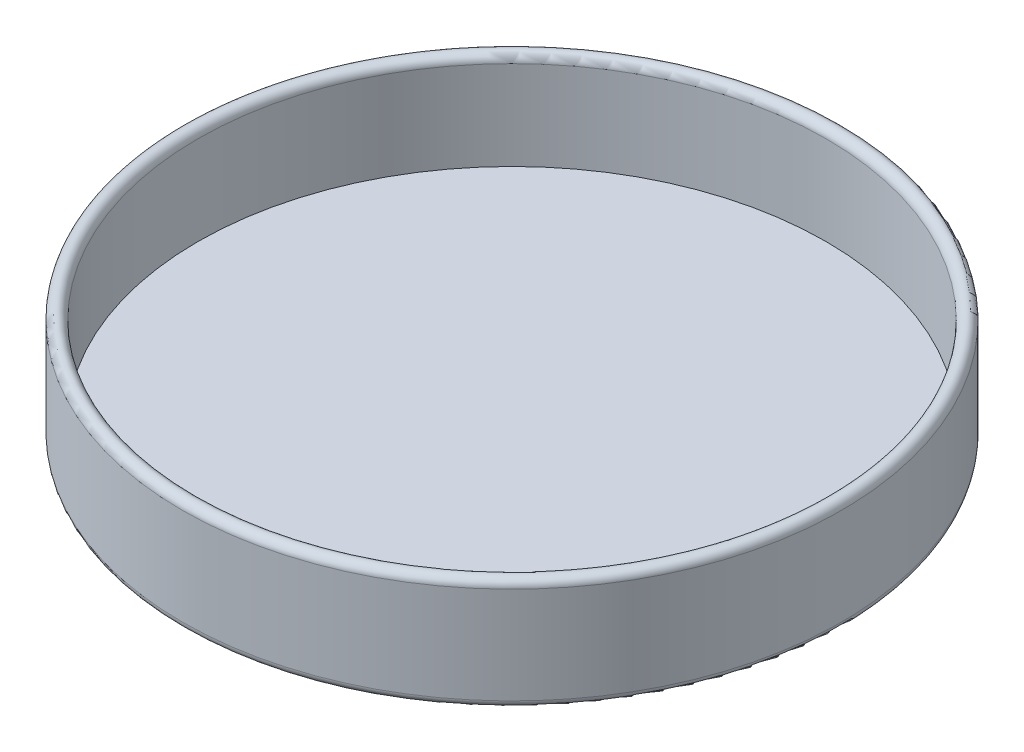
ISO-10303-21;
HEADER;
FILE_DESCRIPTION(('STEP AP214'),'2;1');
FILE_NAME('part.step','',(''),(''),'','','');
FILE_SCHEMA(('AUTOMOTIVE_DESIGN { 1 0 10303 214 1 1 1 1 }'));
ENDSEC;
DATA;
#1=APPLICATION_CONTEXT('core data for automotive mechanical design processes');
#2=APPLICATION_PROTOCOL_DEFINITION('international standard','automotive_design',2000,#1);
#3=PRODUCT_CONTEXT('',#1,'mechanical');
#4=PRODUCT('Part','Part','',(#3));
#5=PRODUCT_RELATED_PRODUCT_CATEGORY('part','',(#4));
#6=PRODUCT_DEFINITION_FORMATION('','',#4);
#7=PRODUCT_DEFINITION_CONTEXT('part definition',#1,'design');
#8=PRODUCT_DEFINITION('design','',#6,#7);
#9=PRODUCT_DEFINITION_SHAPE('','',#8);
#10=(LENGTH_UNIT() NAMED_UNIT(*) SI_UNIT(.MILLI.,.METRE.));
#11=(NAMED_UNIT(*) PLANE_ANGLE_UNIT() SI_UNIT($,.RADIAN.));
#12=(NAMED_UNIT(*) SI_UNIT($,.STERADIAN.) SOLID_ANGLE_UNIT());
#13=UNCERTAINTY_MEASURE_WITH_UNIT(LENGTH_MEASURE(1.E-05),#10,'distance_accuracy_value','');
#14=(GEOMETRIC_REPRESENTATION_CONTEXT(3) GLOBAL_UNCERTAINTY_ASSIGNED_CONTEXT((#13)) GLOBAL_UNIT_ASSIGNED_CONTEXT((#10,
#11,#12)) REPRESENTATION_CONTEXT('',''));
#15=CARTESIAN_POINT('',(0.,0.,0.));
#16=DIRECTION('',(0.,0.,1.));
#17=DIRECTION('',(1.,0.,0.));
#18=AXIS2_PLACEMENT_3D('',#15,#16,#17);
#19=CARTESIAN_POINT('',(0.,14.9,0.));
#20=DIRECTION('',(0.,1.,0.));
#21=DIRECTION('',(0.,0.,1.));
#22=AXIS2_PLACEMENT_3D('',#19,#20,#21);
#23=TOROIDAL_SURFACE('',#22,45.9,1.1);
#24=CARTESIAN_POINT('',(0.,14.9,0.));
#25=DIRECTION('',(0.,1.,0.));
#26=DIRECTION('',(0.,0.,1.));
#27=AXIS2_PLACEMENT_3D('',#24,#25,#26);
#28=CIRCLE('',#27,47.);
#29=CARTESIAN_POINT('',(0.,14.9,47.));
#30=VERTEX_POINT('',#29);
#31=EDGE_CURVE('E48',#30,#30,#28,.F.);
#32=ORIENTED_EDGE('',*,*,#31,.F.);
#33=EDGE_LOOP('',(#32));
#34=FACE_BOUND('',#33,.T.);
#35=CARTESIAN_POINT('',(0.,14.9,0.));
#36=DIRECTION('',(0.,1.,0.));
#37=DIRECTION('',(0.,0.,1.));
#38=AXIS2_PLACEMENT_3D('',#35,#36,#37);
#39=CIRCLE('',#38,44.8);
#40=CARTESIAN_POINT('',(0.,14.9,44.8));
#41=VERTEX_POINT('',#40);
#42=EDGE_CURVE('E44',#41,#41,#39,.T.);
#43=ORIENTED_EDGE('',*,*,#42,.F.);
#44=EDGE_LOOP('',(#43));
#45=FACE_BOUND('',#44,.T.);
#46=ADVANCED_FACE('F33',(#34,#45),#23,.T.);
#47=CARTESIAN_POINT('',(0.,16.,0.));
#48=DIRECTION('',(0.,-1.,0.));
#49=DIRECTION('',(0.,0.,-1.));
#50=AXIS2_PLACEMENT_3D('',#47,#48,#49);
#51=CYLINDRICAL_SURFACE('',#50,47.);
#52=CARTESIAN_POINT('',(0.,1.1,0.));
#53=DIRECTION('',(0.,1.,0.));
#54=DIRECTION('',(0.,0.,1.));
#55=AXIS2_PLACEMENT_3D('',#52,#53,#54);
#56=CIRCLE('',#55,47.);
#57=CARTESIAN_POINT('',(0.,1.1,47.));
#58=VERTEX_POINT('',#57);
#59=EDGE_CURVE('E40',#58,#58,#56,.T.);
#60=ORIENTED_EDGE('',*,*,#59,.T.);
#61=EDGE_LOOP('',(#60));
#62=FACE_BOUND('',#61,.T.);
#63=ORIENTED_EDGE('',*,*,#31,.T.);
#64=EDGE_LOOP('',(#63));
#65=FACE_BOUND('',#64,.T.);
#66=ADVANCED_FACE('F69',(#62,#65),#51,.T.);
#67=CARTESIAN_POINT('',(0.,0.,0.));
#68=DIRECTION('',(0.,1.,0.));
#69=DIRECTION('',(0.,0.,1.));
#70=AXIS2_PLACEMENT_3D('',#67,#68,#69);
#71=PLANE('',#70);
#72=CARTESIAN_POINT('',(0.,0.,0.));
#73=DIRECTION('',(0.,1.,0.));
#74=DIRECTION('',(0.,0.,1.));
#75=AXIS2_PLACEMENT_3D('',#72,#73,#74);
#76=CIRCLE('',#75,45.9);
#77=CARTESIAN_POINT('',(0.,0.,45.9));
#78=VERTEX_POINT('',#77);
#79=EDGE_CURVE('E10',#78,#78,#76,.F.);
#80=ORIENTED_EDGE('',*,*,#79,.T.);
#81=EDGE_LOOP('',(#80));
#82=FACE_BOUND('',#81,.T.);
#83=ADVANCED_FACE('F61',(#82),#71,.F.);
#84=CARTESIAN_POINT('',(0.,2.2,0.));
#85=DIRECTION('',(0.,1.,0.));
#86=DIRECTION('',(0.,0.,1.));
#87=AXIS2_PLACEMENT_3D('',#84,#85,#86);
#88=CYLINDRICAL_SURFACE('',#87,44.8);
#89=CARTESIAN_POINT('',(0.,2.2,0.));
#90=DIRECTION('',(0.,1.,0.));
#91=DIRECTION('',(0.,0.,1.));
#92=AXIS2_PLACEMENT_3D('',#89,#90,#91);
#93=CIRCLE('',#92,44.8);
#94=CARTESIAN_POINT('',(0.,2.2,44.8));
#95=VERTEX_POINT('',#94);
#96=EDGE_CURVE('E53',#95,#95,#93,.T.);
#97=CARTESIAN_POINT('',(0.,14.9,44.8));
#98=CARTESIAN_POINT('',(0.,14.7677083333333,44.8));
#99=CARTESIAN_POINT('',(0.,14.6354166666667,44.8));
#100=CARTESIAN_POINT('',(0.,14.3708333333333,44.8));
#101=CARTESIAN_POINT('',(0.,14.2385416666667,44.8));
#102=CARTESIAN_POINT('',(0.,13.9739583333333,44.8));
#103=CARTESIAN_POINT('',(0.,13.8416666666667,44.8));
#104=CARTESIAN_POINT('',(0.,13.5770833333333,44.8));
#105=CARTESIAN_POINT('',(0.,13.4447916666667,44.8));
#106=CARTESIAN_POINT('',(0.,13.1802083333333,44.8));
#107=CARTESIAN_POINT('',(0.,13.0479166666667,44.8));
#108=CARTESIAN_POINT('',(0.,12.7833333333333,44.8));
#109=CARTESIAN_POINT('',(0.,12.6510416666667,44.8));
#110=CARTESIAN_POINT('',(0.,12.3864583333333,44.8));
#111=CARTESIAN_POINT('',(0.,12.2541666666667,44.8));
#112=CARTESIAN_POINT('',(0.,11.9895833333333,44.8));
#113=CARTESIAN_POINT('',(0.,11.8572916666667,44.8));
#114=CARTESIAN_POINT('',(0.,11.5927083333333,44.8));
#115=CARTESIAN_POINT('',(0.,11.4604166666667,44.8));
#116=CARTESIAN_POINT('',(0.,11.1958333333333,44.8));
#117=CARTESIAN_POINT('',(0.,11.0635416666667,44.8));
#118=CARTESIAN_POINT('',(0.,10.7989583333333,44.8));
#119=CARTESIAN_POINT('',(0.,10.6666666666667,44.8));
#120=CARTESIAN_POINT('',(0.,10.4020833333333,44.8));
#121=CARTESIAN_POINT('',(0.,10.2697916666667,44.8));
#122=CARTESIAN_POINT('',(0.,10.0052083333333,44.8));
#123=CARTESIAN_POINT('',(0.,9.87291666666667,44.8));
#124=CARTESIAN_POINT('',(0.,9.60833333333333,44.8));
#125=CARTESIAN_POINT('',(0.,9.47604166666667,44.8));
#126=CARTESIAN_POINT('',(0.,9.21145833333333,44.8));
#127=CARTESIAN_POINT('',(0.,9.07916666666667,44.8));
#128=CARTESIAN_POINT('',(0.,8.81458333333333,44.8));
#129=CARTESIAN_POINT('',(0.,8.68229166666667,44.8));
#130=CARTESIAN_POINT('',(0.,8.41770833333333,44.8));
#131=CARTESIAN_POINT('',(0.,8.28541666666667,44.8));
#132=CARTESIAN_POINT('',(0.,8.02083333333333,44.8));
#133=CARTESIAN_POINT('',(0.,7.88854166666667,44.8));
#134=CARTESIAN_POINT('',(0.,7.62395833333333,44.8));
#135=CARTESIAN_POINT('',(0.,7.49166666666667,44.8));
#136=CARTESIAN_POINT('',(0.,7.22708333333333,44.8));
#137=CARTESIAN_POINT('',(0.,7.09479166666667,44.8));
#138=CARTESIAN_POINT('',(0.,6.83020833333333,44.8));
#139=CARTESIAN_POINT('',(0.,6.69791666666667,44.8));
#140=CARTESIAN_POINT('',(0.,6.43333333333333,44.8));
#141=CARTESIAN_POINT('',(0.,6.30104166666666,44.8));
#142=CARTESIAN_POINT('',(0.,6.03645833333333,44.8));
#143=CARTESIAN_POINT('',(0.,5.90416666666667,44.8));
#144=CARTESIAN_POINT('',(0.,5.63958333333333,44.8));
#145=CARTESIAN_POINT('',(0.,5.50729166666667,44.8));
#146=CARTESIAN_POINT('',(0.,5.24270833333333,44.8));
#147=CARTESIAN_POINT('',(0.,5.11041666666667,44.8));
#148=CARTESIAN_POINT('',(0.,4.84583333333333,44.8));
#149=CARTESIAN_POINT('',(0.,4.71354166666667,44.8));
#150=CARTESIAN_POINT('',(0.,4.44895833333333,44.8));
#151=CARTESIAN_POINT('',(0.,4.31666666666667,44.8));
#152=CARTESIAN_POINT('',(0.,4.05208333333333,44.8));
#153=CARTESIAN_POINT('',(0.,3.91979166666667,44.8));
#154=CARTESIAN_POINT('',(0.,3.65520833333333,44.8));
#155=CARTESIAN_POINT('',(0.,3.52291666666667,44.8));
#156=CARTESIAN_POINT('',(0.,3.25833333333333,44.8));
#157=CARTESIAN_POINT('',(0.,3.12604166666667,44.8));
#158=CARTESIAN_POINT('',(0.,2.86145833333333,44.8));
#159=CARTESIAN_POINT('',(0.,2.72916666666666,44.8));
#160=CARTESIAN_POINT('',(0.,2.46458333333333,44.8));
#161=CARTESIAN_POINT('',(0.,2.33229166666667,44.8));
#162=CARTESIAN_POINT('',(0.,2.2,44.8));
#163=B_SPLINE_CURVE_WITH_KNOTS('',3,(#97,#98,#99,#100,#101,#102,#103,#104,#105,#106,#107,#108,
#109,#110,#111,#112,#113,#114,#115,#116,#117,#118,#119,#120,#121,#122,#123,#124,#125,#126,#127,
#128,#129,#130,#131,#132,#133,#134,#135,#136,#137,#138,#139,#140,#141,#142,#143,#144,#145,#146,
#147,#148,#149,#150,#151,#152,#153,#154,#155,#156,#157,#158,#159,#160,#161,#162),.UNSPECIFIED.,
.F.,.F.,(4,2,2,2,2,2,2,2,2,2,2,2,2,2,2,2,2,2,2,2,2,2,2,2,2,2,2,2,2,2,2,2,4),(0.,0.396875,
0.793749999999999,1.190625,1.5875,1.984375,2.38125,2.778125,3.175,3.571875,3.96875,4.365625,
4.7625,5.159375,5.55625,5.953125,6.35,6.746875,7.14375,7.540625,7.9375,8.334375,8.73125,
9.128125,9.525,9.921875,10.31875,10.715625,11.1125,11.509375,11.90625,12.303125,12.7),.UNSPECIFIED.);
#164=EDGE_CURVE('BSEAM59',#41,#95,#163,.T.);
#165=ORIENTED_EDGE('',*,*,#42,.T.);
#166=ORIENTED_EDGE('',*,*,#96,.F.);
#167=ORIENTED_EDGE('',*,*,#164,.T.);
#168=ORIENTED_EDGE('',*,*,#164,.F.);
#169=EDGE_LOOP('',(#165,#167,#166,#168));
#170=FACE_BOUND('',#169,.T.);
#171=ADVANCED_FACE('F59',(#170),#88,.F.);
#172=CARTESIAN_POINT('',(0.,2.2,0.));
#173=DIRECTION('',(0.,1.,0.));
#174=DIRECTION('',(0.,0.,1.));
#175=AXIS2_PLACEMENT_3D('',#172,#173,#174);
#176=PLANE('',#175);
#177=ORIENTED_EDGE('',*,*,#96,.T.);
#178=EDGE_LOOP('',(#177));
#179=FACE_BOUND('',#178,.T.);
#180=ADVANCED_FACE('F57',(#179),#176,.T.);
#181=CARTESIAN_POINT('',(0.,1.1,0.));
#182=DIRECTION('',(0.,1.,0.));
#183=DIRECTION('',(0.,0.,1.));
#184=AXIS2_PLACEMENT_3D('',#181,#182,#183);
#185=TOROIDAL_SURFACE('',#184,45.9,1.1);
#186=ORIENTED_EDGE('',*,*,#79,.F.);
#187=EDGE_LOOP('',(#186));
#188=FACE_BOUND('',#187,.T.);
#189=ORIENTED_EDGE('',*,*,#59,.F.);
#190=EDGE_LOOP('',(#189));
#191=FACE_BOUND('',#190,.T.);
#192=ADVANCED_FACE('F35',(#188,#191),#185,.T.);
#193=CLOSED_SHELL('',(#46,#66,#83,#171,#180,#192));
#194=MANIFOLD_SOLID_BREP('B2',#193);
#195=ADVANCED_BREP_SHAPE_REPRESENTATION('',(#18,#194),#14);
#196=SHAPE_DEFINITION_REPRESENTATION(#9,#195);
ENDSEC;
END-ISO-10303-21;
